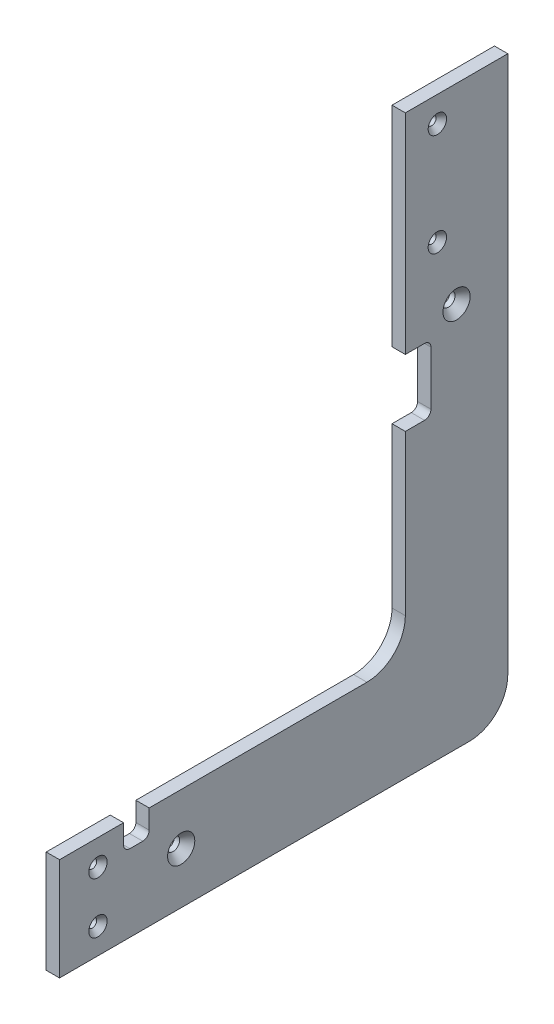
ISO-10303-21;
HEADER;
FILE_DESCRIPTION(('STEP AP214'),'2;1');
FILE_NAME('part.step','',(''),(''),'','','');
FILE_SCHEMA(('AUTOMOTIVE_DESIGN { 1 0 10303 214 1 1 1 1 }'));
ENDSEC;
DATA;
#1=APPLICATION_CONTEXT('core data for automotive mechanical design processes');
#2=APPLICATION_PROTOCOL_DEFINITION('international standard','automotive_design',2000,#1);
#3=PRODUCT_CONTEXT('',#1,'mechanical');
#4=PRODUCT('Part','Part','',(#3));
#5=PRODUCT_RELATED_PRODUCT_CATEGORY('part','',(#4));
#6=PRODUCT_DEFINITION_FORMATION('','',#4);
#7=PRODUCT_DEFINITION_CONTEXT('part definition',#1,'design');
#8=PRODUCT_DEFINITION('design','',#6,#7);
#9=PRODUCT_DEFINITION_SHAPE('','',#8);
#10=(LENGTH_UNIT() NAMED_UNIT(*) SI_UNIT(.MILLI.,.METRE.));
#11=(NAMED_UNIT(*) PLANE_ANGLE_UNIT() SI_UNIT($,.RADIAN.));
#12=(NAMED_UNIT(*) SI_UNIT($,.STERADIAN.) SOLID_ANGLE_UNIT());
#13=UNCERTAINTY_MEASURE_WITH_UNIT(LENGTH_MEASURE(1.E-05),#10,'distance_accuracy_value','');
#14=(GEOMETRIC_REPRESENTATION_CONTEXT(3) GLOBAL_UNCERTAINTY_ASSIGNED_CONTEXT((#13)) GLOBAL_UNIT_ASSIGNED_CONTEXT((#10,
#11,#12)) REPRESENTATION_CONTEXT('',''));
#15=CARTESIAN_POINT('',(0.,0.,0.));
#16=DIRECTION('',(0.,0.,1.));
#17=DIRECTION('',(1.,0.,0.));
#18=AXIS2_PLACEMENT_3D('',#15,#16,#17);
#19=CARTESIAN_POINT('',(6.604,-234.95,0.));
#20=DIRECTION('',(0.,1.,0.));
#21=DIRECTION('',(0.,0.,1.));
#22=AXIS2_PLACEMENT_3D('',#19,#20,#21);
#23=PLANE('',#22);
#24=DIRECTION('',(-1.,0.,0.));
#25=VECTOR('',#24,1.);
#26=CARTESIAN_POINT('',(6.604,-234.95,-44.45));
#27=LINE('',#26,#25);
#28=CARTESIAN_POINT('',(6.604,-234.95,-44.45));
#29=VERTEX_POINT('',#28);
#30=CARTESIAN_POINT('',(0.,-234.95,-44.45));
#31=VERTEX_POINT('',#30);
#32=EDGE_CURVE('E215',#29,#31,#27,.T.);
#33=ORIENTED_EDGE('',*,*,#32,.F.);
#34=DIRECTION('',(0.,0.,-1.));
#35=VECTOR('',#34,1.);
#36=CARTESIAN_POINT('',(6.604,-234.95,0.));
#37=LINE('',#36,#35);
#38=CARTESIAN_POINT('',(6.604,-234.95,-152.4));
#39=VERTEX_POINT('',#38);
#40=EDGE_CURVE('E195',#29,#39,#37,.T.);
#41=ORIENTED_EDGE('',*,*,#40,.T.);
#42=DIRECTION('',(-1.,0.,0.));
#43=VECTOR('',#42,1.);
#44=CARTESIAN_POINT('',(6.604,-234.95,-152.4));
#45=LINE('',#44,#43);
#46=CARTESIAN_POINT('',(0.,-234.95,-152.4));
#47=VERTEX_POINT('',#46);
#48=EDGE_CURVE('E44',#39,#47,#45,.T.);
#49=ORIENTED_EDGE('',*,*,#48,.T.);
#50=DIRECTION('',(0.,0.,-1.));
#51=VECTOR('',#50,1.);
#52=CARTESIAN_POINT('',(0.,-234.95,0.));
#53=LINE('',#52,#51);
#54=EDGE_CURVE('E348',#31,#47,#53,.T.);
#55=ORIENTED_EDGE('',*,*,#54,.F.);
#56=EDGE_LOOP('',(#33,#41,#49,#55));
#57=FACE_BOUND('',#56,.T.);
#58=ADVANCED_FACE('F36',(#57),#23,.T.);
#59=CARTESIAN_POINT('',(6.604,0.,-171.45));
#60=DIRECTION('',(0.,0.,-1.));
#61=DIRECTION('',(0.,1.,0.));
#62=AXIS2_PLACEMENT_3D('',#59,#60,#61);
#63=PLANE('',#62);
#64=DIRECTION('',(0.,-1.,0.));
#65=VECTOR('',#64,1.);
#66=CARTESIAN_POINT('',(6.604,0.,-171.45));
#67=LINE('',#66,#65);
#68=CARTESIAN_POINT('',(6.604,-136.779,-171.45));
#69=VERTEX_POINT('',#68);
#70=CARTESIAN_POINT('',(6.604,-215.9,-171.45));
#71=VERTEX_POINT('',#70);
#72=EDGE_CURVE('E324',#69,#71,#67,.T.);
#73=ORIENTED_EDGE('',*,*,#72,.F.);
#74=DIRECTION('',(-1.,0.,0.));
#75=VECTOR('',#74,1.);
#76=CARTESIAN_POINT('',(6.604,-136.779,-171.45));
#77=LINE('',#76,#75);
#78=CARTESIAN_POINT('',(0.,-136.779,-171.45));
#79=VERTEX_POINT('',#78);
#80=EDGE_CURVE('E253',#69,#79,#77,.T.);
#81=ORIENTED_EDGE('',*,*,#80,.T.);
#82=DIRECTION('',(0.,-1.,0.));
#83=VECTOR('',#82,1.);
#84=CARTESIAN_POINT('',(0.,0.,-171.45));
#85=LINE('',#84,#83);
#86=CARTESIAN_POINT('',(0.,-215.9,-171.45));
#87=VERTEX_POINT('',#86);
#88=EDGE_CURVE('E319',#79,#87,#85,.T.);
#89=ORIENTED_EDGE('',*,*,#88,.T.);
#90=DIRECTION('',(-1.,0.,0.));
#91=VECTOR('',#90,1.);
#92=CARTESIAN_POINT('',(6.604,-215.9,-171.45));
#93=LINE('',#92,#91);
#94=EDGE_CURVE('E11',#71,#87,#93,.T.);
#95=ORIENTED_EDGE('',*,*,#94,.F.);
#96=EDGE_LOOP('',(#73,#81,#89,#95));
#97=FACE_BOUND('',#96,.T.);
#98=ADVANCED_FACE('F449',(#97),#63,.F.);
#99=CARTESIAN_POINT('',(0.,0.,-171.45));
#100=VERTEX_POINT('',#99);
#101=CARTESIAN_POINT('',(0.,-103.759,-171.45));
#102=VERTEX_POINT('',#101);
#103=EDGE_CURVE('E342',#100,#102,#85,.T.);
#104=ORIENTED_EDGE('',*,*,#103,.T.);
#105=DIRECTION('',(-1.,0.,0.));
#106=VECTOR('',#105,1.);
#107=CARTESIAN_POINT('',(6.604,-103.759,-171.45));
#108=LINE('',#107,#106);
#109=CARTESIAN_POINT('',(6.604,-103.759,-171.45));
#110=VERTEX_POINT('',#109);
#111=EDGE_CURVE('E59',#110,#102,#108,.T.);
#112=ORIENTED_EDGE('',*,*,#111,.F.);
#113=CARTESIAN_POINT('',(6.604,0.,-171.45));
#114=VERTEX_POINT('',#113);
#115=EDGE_CURVE('E320',#114,#110,#67,.T.);
#116=ORIENTED_EDGE('',*,*,#115,.F.);
#117=DIRECTION('',(-1.,0.,0.));
#118=VECTOR('',#117,1.);
#119=CARTESIAN_POINT('',(6.604,0.,-171.45));
#120=LINE('',#119,#118);
#121=EDGE_CURVE('E341',#114,#100,#120,.T.);
#122=ORIENTED_EDGE('',*,*,#121,.T.);
#123=EDGE_LOOP('',(#104,#112,#116,#122));
#124=FACE_BOUND('',#123,.T.);
#125=ADVANCED_FACE('F38',(#124),#63,.F.);
#126=CARTESIAN_POINT('',(6.604,-215.9,-152.4));
#127=DIRECTION('',(-1.,0.,0.));
#128=DIRECTION('',(0.,0.,1.));
#129=AXIS2_PLACEMENT_3D('',#126,#127,#128);
#130=CYLINDRICAL_SURFACE('',#129,19.05);
#131=CARTESIAN_POINT('',(0.,-215.9,-152.4));
#132=DIRECTION('',(1.,0.,0.));
#133=DIRECTION('',(0.,0.,-1.));
#134=AXIS2_PLACEMENT_3D('',#131,#132,#133);
#135=CIRCLE('',#134,19.05);
#136=EDGE_CURVE('E345',#87,#47,#135,.F.);
#137=ORIENTED_EDGE('',*,*,#136,.T.);
#138=ORIENTED_EDGE('',*,*,#48,.F.);
#139=CARTESIAN_POINT('',(6.604,-215.9,-152.4));
#140=DIRECTION('',(1.,0.,0.));
#141=DIRECTION('',(0.,0.,-1.));
#142=AXIS2_PLACEMENT_3D('',#139,#140,#141);
#143=CIRCLE('',#142,19.05);
#144=EDGE_CURVE('E323',#71,#39,#143,.F.);
#145=ORIENTED_EDGE('',*,*,#144,.F.);
#146=ORIENTED_EDGE('',*,*,#94,.T.);
#147=EDGE_LOOP('',(#137,#138,#145,#146));
#148=FACE_BOUND('',#147,.T.);
#149=ADVANCED_FACE('F384',(#148),#130,.F.);
#150=DIRECTION('',(-1.,0.,0.));
#151=VECTOR('',#150,1.);
#152=CARTESIAN_POINT('',(6.604,-234.95,-31.75));
#153=LINE('',#152,#151);
#154=CARTESIAN_POINT('',(6.604,-234.95,-31.75));
#155=VERTEX_POINT('',#154);
#156=CARTESIAN_POINT('',(0.,-234.95,-31.75));
#157=VERTEX_POINT('',#156);
#158=EDGE_CURVE('E218',#155,#157,#153,.T.);
#159=ORIENTED_EDGE('',*,*,#158,.T.);
#160=CARTESIAN_POINT('',(0.,-234.95,0.));
#161=VERTEX_POINT('',#160);
#162=EDGE_CURVE('E349',#161,#157,#53,.T.);
#163=ORIENTED_EDGE('',*,*,#162,.F.);
#164=DIRECTION('',(-1.,0.,0.));
#165=VECTOR('',#164,1.);
#166=CARTESIAN_POINT('',(6.604,-234.95,0.));
#167=LINE('',#166,#165);
#168=CARTESIAN_POINT('',(6.604,-234.95,0.));
#169=VERTEX_POINT('',#168);
#170=EDGE_CURVE('E376',#169,#161,#167,.T.);
#171=ORIENTED_EDGE('',*,*,#170,.F.);
#172=EDGE_CURVE('E326',#169,#155,#37,.T.);
#173=ORIENTED_EDGE('',*,*,#172,.T.);
#174=EDGE_LOOP('',(#159,#163,#171,#173));
#175=FACE_BOUND('',#174,.T.);
#176=ADVANCED_FACE('F404',(#175),#23,.T.);
#177=CARTESIAN_POINT('',(6.604,0.,0.));
#178=DIRECTION('',(0.,0.,-1.));
#179=DIRECTION('',(-1.,0.,0.));
#180=AXIS2_PLACEMENT_3D('',#177,#178,#179);
#181=PLANE('',#180);
#182=DIRECTION('',(0.,-1.,0.));
#183=VECTOR('',#182,1.);
#184=CARTESIAN_POINT('',(0.,0.,0.));
#185=LINE('',#184,#183);
#186=CARTESIAN_POINT('',(0.,-285.75,0.));
#187=VERTEX_POINT('',#186);
#188=EDGE_CURVE('E352',#161,#187,#185,.T.);
#189=ORIENTED_EDGE('',*,*,#188,.T.);
#190=DIRECTION('',(-1.,0.,0.));
#191=VECTOR('',#190,1.);
#192=CARTESIAN_POINT('',(6.604,-285.75,0.));
#193=LINE('',#192,#191);
#194=CARTESIAN_POINT('',(6.604,-285.75,0.));
#195=VERTEX_POINT('',#194);
#196=EDGE_CURVE('E373',#195,#187,#193,.T.);
#197=ORIENTED_EDGE('',*,*,#196,.F.);
#198=DIRECTION('',(0.,-1.,0.));
#199=VECTOR('',#198,1.);
#200=CARTESIAN_POINT('',(6.604,0.,0.));
#201=LINE('',#200,#199);
#202=EDGE_CURVE('E329',#169,#195,#201,.T.);
#203=ORIENTED_EDGE('',*,*,#202,.F.);
#204=ORIENTED_EDGE('',*,*,#170,.T.);
#205=EDGE_LOOP('',(#189,#197,#203,#204));
#206=FACE_BOUND('',#205,.T.);
#207=ADVANCED_FACE('F410',(#206),#181,.F.);
#208=CARTESIAN_POINT('',(6.604,-285.75,0.));
#209=DIRECTION('',(0.,1.,0.));
#210=DIRECTION('',(0.,0.,1.));
#211=AXIS2_PLACEMENT_3D('',#208,#209,#210);
#212=PLANE('',#211);
#213=DIRECTION('',(0.,0.,-1.));
#214=VECTOR('',#213,1.);
#215=CARTESIAN_POINT('',(0.,-285.75,0.));
#216=LINE('',#215,#214);
#217=CARTESIAN_POINT('',(0.,-285.75,-203.2));
#218=VERTEX_POINT('',#217);
#219=EDGE_CURVE('E354',#187,#218,#216,.T.);
#220=ORIENTED_EDGE('',*,*,#219,.T.);
#221=DIRECTION('',(-1.,0.,0.));
#222=VECTOR('',#221,1.);
#223=CARTESIAN_POINT('',(6.604,-285.75,-203.2));
#224=LINE('',#223,#222);
#225=CARTESIAN_POINT('',(6.604,-285.75,-203.2));
#226=VERTEX_POINT('',#225);
#227=EDGE_CURVE('E370',#226,#218,#224,.T.);
#228=ORIENTED_EDGE('',*,*,#227,.F.);
#229=DIRECTION('',(0.,0.,-1.));
#230=VECTOR('',#229,1.);
#231=CARTESIAN_POINT('',(6.604,-285.75,0.));
#232=LINE('',#231,#230);
#233=EDGE_CURVE('E331',#195,#226,#232,.T.);
#234=ORIENTED_EDGE('',*,*,#233,.F.);
#235=ORIENTED_EDGE('',*,*,#196,.T.);
#236=EDGE_LOOP('',(#220,#228,#234,#235));
#237=FACE_BOUND('',#236,.T.);
#238=ADVANCED_FACE('F414',(#237),#212,.F.);
#239=CARTESIAN_POINT('',(6.604,-266.7,-203.2));
#240=DIRECTION('',(-1.,0.,0.));
#241=DIRECTION('',(0.,0.,1.));
#242=AXIS2_PLACEMENT_3D('',#239,#240,#241);
#243=CYLINDRICAL_SURFACE('',#242,19.0500000000001);
#244=CARTESIAN_POINT('',(0.,-266.7,-203.2));
#245=DIRECTION('',(1.,0.,0.));
#246=DIRECTION('',(0.,0.,-1.));
#247=AXIS2_PLACEMENT_3D('',#244,#245,#246);
#248=CIRCLE('',#247,19.0500000000001);
#249=CARTESIAN_POINT('',(0.,-266.7,-222.25));
#250=VERTEX_POINT('',#249);
#251=EDGE_CURVE('E356',#218,#250,#248,.T.);
#252=ORIENTED_EDGE('',*,*,#251,.T.);
#253=DIRECTION('',(-1.,0.,0.));
#254=VECTOR('',#253,1.);
#255=CARTESIAN_POINT('',(6.604,-266.7,-222.25));
#256=LINE('',#255,#254);
#257=CARTESIAN_POINT('',(6.604,-266.7,-222.25));
#258=VERTEX_POINT('',#257);
#259=EDGE_CURVE('E368',#258,#250,#256,.T.);
#260=ORIENTED_EDGE('',*,*,#259,.F.);
#261=CARTESIAN_POINT('',(6.604,-266.7,-203.2));
#262=DIRECTION('',(1.,0.,0.));
#263=DIRECTION('',(0.,0.,-1.));
#264=AXIS2_PLACEMENT_3D('',#261,#262,#263);
#265=CIRCLE('',#264,19.0500000000001);
#266=EDGE_CURVE('E333',#226,#258,#265,.T.);
#267=ORIENTED_EDGE('',*,*,#266,.F.);
#268=ORIENTED_EDGE('',*,*,#227,.T.);
#269=EDGE_LOOP('',(#252,#260,#267,#268));
#270=FACE_BOUND('',#269,.T.);
#271=ADVANCED_FACE('F421',(#270),#243,.T.);
#272=CARTESIAN_POINT('',(6.604,0.,-222.25));
#273=DIRECTION('',(0.,0.,-1.));
#274=DIRECTION('',(0.,1.,0.));
#275=AXIS2_PLACEMENT_3D('',#272,#273,#274);
#276=PLANE('',#275);
#277=DIRECTION('',(0.,-1.,0.));
#278=VECTOR('',#277,1.);
#279=CARTESIAN_POINT('',(0.,0.,-222.25));
#280=LINE('',#279,#278);
#281=CARTESIAN_POINT('',(0.,0.,-222.25));
#282=VERTEX_POINT('',#281);
#283=EDGE_CURVE('E359',#282,#250,#280,.T.);
#284=ORIENTED_EDGE('',*,*,#283,.F.);
#285=DIRECTION('',(-1.,0.,0.));
#286=VECTOR('',#285,1.);
#287=CARTESIAN_POINT('',(6.604,0.,-222.25));
#288=LINE('',#287,#286);
#289=CARTESIAN_POINT('',(6.604,0.,-222.25));
#290=VERTEX_POINT('',#289);
#291=EDGE_CURVE('E366',#290,#282,#288,.T.);
#292=ORIENTED_EDGE('',*,*,#291,.F.);
#293=DIRECTION('',(0.,-1.,0.));
#294=VECTOR('',#293,1.);
#295=CARTESIAN_POINT('',(6.604,0.,-222.25));
#296=LINE('',#295,#294);
#297=EDGE_CURVE('E335',#290,#258,#296,.T.);
#298=ORIENTED_EDGE('',*,*,#297,.T.);
#299=ORIENTED_EDGE('',*,*,#259,.T.);
#300=EDGE_LOOP('',(#284,#292,#298,#299));
#301=FACE_BOUND('',#300,.T.);
#302=ADVANCED_FACE('F424',(#301),#276,.T.);
#303=CARTESIAN_POINT('',(6.604,0.,0.));
#304=DIRECTION('',(0.,1.,0.));
#305=DIRECTION('',(0.,0.,1.));
#306=AXIS2_PLACEMENT_3D('',#303,#304,#305);
#307=PLANE('',#306);
#308=DIRECTION('',(0.,0.,-1.));
#309=VECTOR('',#308,1.);
#310=CARTESIAN_POINT('',(0.,0.,0.));
#311=LINE('',#310,#309);
#312=EDGE_CURVE('E362',#100,#282,#311,.T.);
#313=ORIENTED_EDGE('',*,*,#312,.F.);
#314=ORIENTED_EDGE('',*,*,#121,.F.);
#315=DIRECTION('',(0.,0.,-1.));
#316=VECTOR('',#315,1.);
#317=CARTESIAN_POINT('',(6.604,0.,0.));
#318=LINE('',#317,#316);
#319=EDGE_CURVE('E338',#114,#290,#318,.T.);
#320=ORIENTED_EDGE('',*,*,#319,.T.);
#321=ORIENTED_EDGE('',*,*,#291,.T.);
#322=EDGE_LOOP('',(#313,#314,#320,#321));
#323=FACE_BOUND('',#322,.T.);
#324=ADVANCED_FACE('F427',(#323),#307,.T.);
#325=CARTESIAN_POINT('',(6.604,0.,0.));
#326=DIRECTION('',(1.,0.,0.));
#327=DIRECTION('',(0.,0.,-1.));
#328=AXIS2_PLACEMENT_3D('',#325,#326,#327);
#329=PLANE('',#328);
#330=DIRECTION('',(0.,-1.,0.));
#331=VECTOR('',#330,1.);
#332=CARTESIAN_POINT('',(6.604,-234.95,-44.45));
#333=LINE('',#332,#331);
#334=CARTESIAN_POINT('',(6.604,-244.475,-44.45));
#335=VERTEX_POINT('',#334);
#336=EDGE_CURVE('E175',#29,#335,#333,.T.);
#337=ORIENTED_EDGE('',*,*,#336,.T.);
#338=CARTESIAN_POINT('',(6.604,-244.475,-41.275));
#339=DIRECTION('',(-1.,0.,0.));
#340=DIRECTION('',(0.,0.,-1.));
#341=AXIS2_PLACEMENT_3D('',#338,#339,#340);
#342=CIRCLE('',#341,3.17500000000001);
#343=CARTESIAN_POINT('',(6.604,-247.65,-41.275));
#344=VERTEX_POINT('',#343);
#345=EDGE_CURVE('E184',#335,#344,#342,.T.);
#346=ORIENTED_EDGE('',*,*,#345,.T.);
#347=DIRECTION('',(0.,0.,1.));
#348=VECTOR('',#347,1.);
#349=CARTESIAN_POINT('',(6.604,-247.65,-41.275));
#350=LINE('',#349,#348);
#351=CARTESIAN_POINT('',(6.604,-247.65,-34.925));
#352=VERTEX_POINT('',#351);
#353=EDGE_CURVE('E189',#344,#352,#350,.T.);
#354=ORIENTED_EDGE('',*,*,#353,.T.);
#355=CARTESIAN_POINT('',(6.604,-244.475,-34.925));
#356=DIRECTION('',(-1.,0.,0.));
#357=DIRECTION('',(0.,0.,1.));
#358=AXIS2_PLACEMENT_3D('',#355,#356,#357);
#359=CIRCLE('',#358,3.175);
#360=CARTESIAN_POINT('',(6.604,-244.475,-31.75));
#361=VERTEX_POINT('',#360);
#362=EDGE_CURVE('E202',#352,#361,#359,.T.);
#363=ORIENTED_EDGE('',*,*,#362,.T.);
#364=DIRECTION('',(0.,1.,0.));
#365=VECTOR('',#364,1.);
#366=CARTESIAN_POINT('',(6.604,-234.95,-31.75));
#367=LINE('',#366,#365);
#368=EDGE_CURVE('E181',#361,#155,#367,.T.);
#369=ORIENTED_EDGE('',*,*,#368,.T.);
#370=ORIENTED_EDGE('',*,*,#172,.F.);
#371=ORIENTED_EDGE('',*,*,#202,.T.);
#372=ORIENTED_EDGE('',*,*,#233,.T.);
#373=ORIENTED_EDGE('',*,*,#266,.T.);
#374=ORIENTED_EDGE('',*,*,#297,.F.);
#375=ORIENTED_EDGE('',*,*,#319,.F.);
#376=ORIENTED_EDGE('',*,*,#115,.T.);
#377=DIRECTION('',(0.,0.,-1.));
#378=VECTOR('',#377,1.);
#379=CARTESIAN_POINT('',(6.604,-103.759,-171.45));
#380=LINE('',#379,#378);
#381=CARTESIAN_POINT('',(6.604,-103.759,-180.975));
#382=VERTEX_POINT('',#381);
#383=EDGE_CURVE('E226',#110,#382,#380,.T.);
#384=ORIENTED_EDGE('',*,*,#383,.T.);
#385=CARTESIAN_POINT('',(6.604,-106.934,-180.975));
#386=DIRECTION('',(-1.,0.,0.));
#387=DIRECTION('',(0.,0.,-1.));
#388=AXIS2_PLACEMENT_3D('',#385,#386,#387);
#389=CIRCLE('',#388,3.175);
#390=CARTESIAN_POINT('',(6.604,-106.934,-184.15));
#391=VERTEX_POINT('',#390);
#392=EDGE_CURVE('E229',#382,#391,#389,.T.);
#393=ORIENTED_EDGE('',*,*,#392,.T.);
#394=DIRECTION('',(0.,-1.,0.));
#395=VECTOR('',#394,1.);
#396=CARTESIAN_POINT('',(6.604,-106.934,-184.15));
#397=LINE('',#396,#395);
#398=CARTESIAN_POINT('',(6.604,-133.604,-184.15));
#399=VERTEX_POINT('',#398);
#400=EDGE_CURVE('E233',#391,#399,#397,.T.);
#401=ORIENTED_EDGE('',*,*,#400,.T.);
#402=CARTESIAN_POINT('',(6.604,-133.604,-180.975));
#403=DIRECTION('',(-1.,0.,0.));
#404=DIRECTION('',(0.,0.,-1.));
#405=AXIS2_PLACEMENT_3D('',#402,#403,#404);
#406=CIRCLE('',#405,3.175);
#407=CARTESIAN_POINT('',(6.604,-136.779,-180.975));
#408=VERTEX_POINT('',#407);
#409=EDGE_CURVE('E236',#399,#408,#406,.T.);
#410=ORIENTED_EDGE('',*,*,#409,.T.);
#411=DIRECTION('',(0.,0.,1.));
#412=VECTOR('',#411,1.);
#413=CARTESIAN_POINT('',(6.604,-136.779,-171.45));
#414=LINE('',#413,#412);
#415=EDGE_CURVE('E239',#408,#69,#414,.T.);
#416=ORIENTED_EDGE('',*,*,#415,.T.);
#417=ORIENTED_EDGE('',*,*,#72,.T.);
#418=ORIENTED_EDGE('',*,*,#144,.T.);
#419=ORIENTED_EDGE('',*,*,#40,.F.);
#420=EDGE_LOOP('',(#337,#346,#354,#363,#369,#370,#371,#372,#373,#374,#375,#376,#384,#393,#401,
#410,#416,#417,#418,#419));
#421=FACE_BOUND('',#420,.T.);
#422=CARTESIAN_POINT('',(6.604,-94.869,-196.85));
#423=DIRECTION('',(1.,0.,0.));
#424=DIRECTION('',(0.,0.,-1.));
#425=AXIS2_PLACEMENT_3D('',#422,#423,#424);
#426=CIRCLE('',#425,6.7437);
#427=CARTESIAN_POINT('',(6.604,-94.869,-203.5937));
#428=VERTEX_POINT('',#427);
#429=EDGE_CURVE('E256',#428,#428,#426,.T.);
#430=ORIENTED_EDGE('',*,*,#429,.F.);
#431=EDGE_LOOP('',(#430));
#432=FACE_BOUND('',#431,.T.);
#433=CARTESIAN_POINT('',(6.604,-260.35,-60.325));
#434=DIRECTION('',(1.,0.,0.));
#435=DIRECTION('',(0.,0.,-1.));
#436=AXIS2_PLACEMENT_3D('',#433,#434,#435);
#437=CIRCLE('',#436,6.74370000000002);
#438=CARTESIAN_POINT('',(6.604,-260.35,-67.0687));
#439=VERTEX_POINT('',#438);
#440=EDGE_CURVE('E274',#439,#439,#437,.T.);
#441=ORIENTED_EDGE('',*,*,#440,.F.);
#442=EDGE_LOOP('',(#441));
#443=FACE_BOUND('',#442,.T.);
#444=CARTESIAN_POINT('',(6.604,-247.65,-19.05));
#445=DIRECTION('',(1.,0.,0.));
#446=DIRECTION('',(0.,0.,-1.));
#447=AXIS2_PLACEMENT_3D('',#444,#445,#446);
#448=CIRCLE('',#447,4.55929999999999);
#449=CARTESIAN_POINT('',(6.604,-247.65,-23.6093));
#450=VERTEX_POINT('',#449);
#451=EDGE_CURVE('E283',#450,#450,#448,.T.);
#452=ORIENTED_EDGE('',*,*,#451,.F.);
#453=EDGE_LOOP('',(#452));
#454=FACE_BOUND('',#453,.T.);
#455=CARTESIAN_POINT('',(6.604,-273.05,-19.05));
#456=DIRECTION('',(1.,0.,0.));
#457=DIRECTION('',(0.,0.,-1.));
#458=AXIS2_PLACEMENT_3D('',#455,#456,#457);
#459=CIRCLE('',#458,4.55929999999999);
#460=CARTESIAN_POINT('',(6.604,-273.05,-23.6093));
#461=VERTEX_POINT('',#460);
#462=EDGE_CURVE('E292',#461,#461,#459,.T.);
#463=ORIENTED_EDGE('',*,*,#462,.F.);
#464=EDGE_LOOP('',(#463));
#465=FACE_BOUND('',#464,.T.);
#466=CARTESIAN_POINT('',(6.604,-12.7,-187.325));
#467=DIRECTION('',(1.,0.,0.));
#468=DIRECTION('',(0.,0.,-1.));
#469=AXIS2_PLACEMENT_3D('',#466,#467,#468);
#470=CIRCLE('',#469,4.5593);
#471=CARTESIAN_POINT('',(6.604,-12.7,-191.8843));
#472=VERTEX_POINT('',#471);
#473=EDGE_CURVE('E301',#472,#472,#470,.T.);
#474=ORIENTED_EDGE('',*,*,#473,.F.);
#475=EDGE_LOOP('',(#474));
#476=FACE_BOUND('',#475,.T.);
#477=CARTESIAN_POINT('',(6.604,-63.5,-187.325));
#478=DIRECTION('',(1.,0.,0.));
#479=DIRECTION('',(0.,0.,-1.));
#480=AXIS2_PLACEMENT_3D('',#477,#478,#479);
#481=CIRCLE('',#480,4.5593);
#482=CARTESIAN_POINT('',(6.604,-63.5,-191.8843));
#483=VERTEX_POINT('',#482);
#484=EDGE_CURVE('E310',#483,#483,#481,.T.);
#485=ORIENTED_EDGE('',*,*,#484,.F.);
#486=EDGE_LOOP('',(#485));
#487=FACE_BOUND('',#486,.T.);
#488=ADVANCED_FACE('F192',(#421,#432,#443,#454,#465,#476,#487),#329,.T.);
#489=CARTESIAN_POINT('',(0.,0.,0.));
#490=DIRECTION('',(1.,0.,0.));
#491=DIRECTION('',(0.,0.,-1.));
#492=AXIS2_PLACEMENT_3D('',#489,#490,#491);
#493=PLANE('',#492);
#494=CARTESIAN_POINT('',(0.,-94.869,-196.85));
#495=DIRECTION('',(1.,0.,0.));
#496=DIRECTION('',(0.,0.,-1.));
#497=AXIS2_PLACEMENT_3D('',#494,#495,#496);
#498=CIRCLE('',#497,3.2639);
#499=CARTESIAN_POINT('',(0.,-94.869,-200.1139));
#500=VERTEX_POINT('',#499);
#501=EDGE_CURVE('E271',#500,#500,#498,.T.);
#502=ORIENTED_EDGE('',*,*,#501,.T.);
#503=EDGE_LOOP('',(#502));
#504=FACE_BOUND('',#503,.T.);
#505=CARTESIAN_POINT('',(0.,-260.35,-60.325));
#506=DIRECTION('',(1.,0.,0.));
#507=DIRECTION('',(0.,0.,-1.));
#508=AXIS2_PLACEMENT_3D('',#505,#506,#507);
#509=CIRCLE('',#508,3.26389999999999);
#510=CARTESIAN_POINT('',(0.,-260.35,-63.5889));
#511=VERTEX_POINT('',#510);
#512=EDGE_CURVE('E280',#511,#511,#509,.T.);
#513=ORIENTED_EDGE('',*,*,#512,.T.);
#514=EDGE_LOOP('',(#513));
#515=FACE_BOUND('',#514,.T.);
#516=CARTESIAN_POINT('',(0.,-247.65,-19.05));
#517=DIRECTION('',(1.,0.,0.));
#518=DIRECTION('',(0.,0.,-1.));
#519=AXIS2_PLACEMENT_3D('',#516,#517,#518);
#520=CIRCLE('',#519,2.15265000000001);
#521=CARTESIAN_POINT('',(0.,-247.65,-21.20265));
#522=VERTEX_POINT('',#521);
#523=EDGE_CURVE('E289',#522,#522,#520,.T.);
#524=ORIENTED_EDGE('',*,*,#523,.T.);
#525=EDGE_LOOP('',(#524));
#526=FACE_BOUND('',#525,.T.);
#527=CARTESIAN_POINT('',(0.,-273.05,-19.05));
#528=DIRECTION('',(1.,0.,0.));
#529=DIRECTION('',(0.,0.,-1.));
#530=AXIS2_PLACEMENT_3D('',#527,#528,#529);
#531=CIRCLE('',#530,2.15264999999998);
#532=CARTESIAN_POINT('',(0.,-273.05,-21.20265));
#533=VERTEX_POINT('',#532);
#534=EDGE_CURVE('E298',#533,#533,#531,.T.);
#535=ORIENTED_EDGE('',*,*,#534,.T.);
#536=EDGE_LOOP('',(#535));
#537=FACE_BOUND('',#536,.T.);
#538=CARTESIAN_POINT('',(0.,-12.7,-187.325));
#539=DIRECTION('',(1.,0.,0.));
#540=DIRECTION('',(0.,0.,-1.));
#541=AXIS2_PLACEMENT_3D('',#538,#539,#540);
#542=CIRCLE('',#541,2.15265);
#543=CARTESIAN_POINT('',(0.,-12.7,-189.47765));
#544=VERTEX_POINT('',#543);
#545=EDGE_CURVE('E307',#544,#544,#542,.T.);
#546=ORIENTED_EDGE('',*,*,#545,.T.);
#547=EDGE_LOOP('',(#546));
#548=FACE_BOUND('',#547,.T.);
#549=CARTESIAN_POINT('',(0.,-63.5,-187.325));
#550=DIRECTION('',(1.,0.,0.));
#551=DIRECTION('',(0.,0.,-1.));
#552=AXIS2_PLACEMENT_3D('',#549,#550,#551);
#553=CIRCLE('',#552,2.15265);
#554=CARTESIAN_POINT('',(0.,-63.5,-189.47765));
#555=VERTEX_POINT('',#554);
#556=EDGE_CURVE('E316',#555,#555,#553,.T.);
#557=ORIENTED_EDGE('',*,*,#556,.T.);
#558=EDGE_LOOP('',(#557));
#559=FACE_BOUND('',#558,.T.);
#560=CARTESIAN_POINT('',(0.,-244.475,-41.275));
#561=DIRECTION('',(-1.,0.,0.));
#562=DIRECTION('',(0.,0.,-1.));
#563=AXIS2_PLACEMENT_3D('',#560,#561,#562);
#564=CIRCLE('',#563,3.17500000000001);
#565=CARTESIAN_POINT('',(0.,-244.475,-44.45));
#566=VERTEX_POINT('',#565);
#567=CARTESIAN_POINT('',(0.,-247.65,-41.275));
#568=VERTEX_POINT('',#567);
#569=EDGE_CURVE('E208',#566,#568,#564,.T.);
#570=ORIENTED_EDGE('',*,*,#569,.F.);
#571=DIRECTION('',(0.,-1.,0.));
#572=VECTOR('',#571,1.);
#573=CARTESIAN_POINT('',(0.,-234.95,-44.45));
#574=LINE('',#573,#572);
#575=EDGE_CURVE('E51',#31,#566,#574,.T.);
#576=ORIENTED_EDGE('',*,*,#575,.F.);
#577=ORIENTED_EDGE('',*,*,#54,.T.);
#578=ORIENTED_EDGE('',*,*,#136,.F.);
#579=ORIENTED_EDGE('',*,*,#88,.F.);
#580=DIRECTION('',(0.,0.,1.));
#581=VECTOR('',#580,1.);
#582=CARTESIAN_POINT('',(0.,-136.779,-171.45));
#583=LINE('',#582,#581);
#584=CARTESIAN_POINT('',(0.,-136.779,-180.975));
#585=VERTEX_POINT('',#584);
#586=EDGE_CURVE('E230',#585,#79,#583,.T.);
#587=ORIENTED_EDGE('',*,*,#586,.F.);
#588=CARTESIAN_POINT('',(0.,-133.604,-180.975));
#589=DIRECTION('',(-1.,0.,0.));
#590=DIRECTION('',(0.,0.,-1.));
#591=AXIS2_PLACEMENT_3D('',#588,#589,#590);
#592=CIRCLE('',#591,3.175);
#593=CARTESIAN_POINT('',(0.,-133.604,-184.15));
#594=VERTEX_POINT('',#593);
#595=EDGE_CURVE('E249',#594,#585,#592,.T.);
#596=ORIENTED_EDGE('',*,*,#595,.F.);
#597=DIRECTION('',(0.,-1.,0.));
#598=VECTOR('',#597,1.);
#599=CARTESIAN_POINT('',(0.,-106.934,-184.15));
#600=LINE('',#599,#598);
#601=CARTESIAN_POINT('',(0.,-106.934,-184.15));
#602=VERTEX_POINT('',#601);
#603=EDGE_CURVE('E246',#602,#594,#600,.T.);
#604=ORIENTED_EDGE('',*,*,#603,.F.);
#605=CARTESIAN_POINT('',(0.,-106.934,-180.975));
#606=DIRECTION('',(-1.,0.,0.));
#607=DIRECTION('',(0.,0.,-1.));
#608=AXIS2_PLACEMENT_3D('',#605,#606,#607);
#609=CIRCLE('',#608,3.175);
#610=CARTESIAN_POINT('',(0.,-103.759,-180.975));
#611=VERTEX_POINT('',#610);
#612=EDGE_CURVE('E243',#611,#602,#609,.T.);
#613=ORIENTED_EDGE('',*,*,#612,.F.);
#614=DIRECTION('',(0.,0.,-1.));
#615=VECTOR('',#614,1.);
#616=CARTESIAN_POINT('',(0.,-103.759,-171.45));
#617=LINE('',#616,#615);
#618=EDGE_CURVE('E217',#102,#611,#617,.T.);
#619=ORIENTED_EDGE('',*,*,#618,.F.);
#620=ORIENTED_EDGE('',*,*,#103,.F.);
#621=ORIENTED_EDGE('',*,*,#312,.T.);
#622=ORIENTED_EDGE('',*,*,#283,.T.);
#623=ORIENTED_EDGE('',*,*,#251,.F.);
#624=ORIENTED_EDGE('',*,*,#219,.F.);
#625=ORIENTED_EDGE('',*,*,#188,.F.);
#626=ORIENTED_EDGE('',*,*,#162,.T.);
#627=DIRECTION('',(0.,1.,0.));
#628=VECTOR('',#627,1.);
#629=CARTESIAN_POINT('',(0.,-234.95,-31.75));
#630=LINE('',#629,#628);
#631=CARTESIAN_POINT('',(0.,-244.475,-31.75));
#632=VERTEX_POINT('',#631);
#633=EDGE_CURVE('E196',#632,#157,#630,.T.);
#634=ORIENTED_EDGE('',*,*,#633,.F.);
#635=CARTESIAN_POINT('',(0.,-244.475,-34.925));
#636=DIRECTION('',(-1.,0.,0.));
#637=DIRECTION('',(0.,0.,1.));
#638=AXIS2_PLACEMENT_3D('',#635,#636,#637);
#639=CIRCLE('',#638,3.175);
#640=CARTESIAN_POINT('',(0.,-247.65,-34.925));
#641=VERTEX_POINT('',#640);
#642=EDGE_CURVE('E198',#641,#632,#639,.T.);
#643=ORIENTED_EDGE('',*,*,#642,.F.);
#644=DIRECTION('',(0.,0.,1.));
#645=VECTOR('',#644,1.);
#646=CARTESIAN_POINT('',(0.,-247.65,-41.275));
#647=LINE('',#646,#645);
#648=EDGE_CURVE('E210',#568,#641,#647,.T.);
#649=ORIENTED_EDGE('',*,*,#648,.F.);
#650=EDGE_LOOP('',(#570,#576,#577,#578,#579,#587,#596,#604,#613,#619,#620,#621,#622,#623,#624,
#625,#626,#634,#643,#649));
#651=FACE_BOUND('',#650,.T.);
#652=ADVANCED_FACE('F388',(#504,#515,#526,#537,#548,#559,#651),#493,.F.);
#653=CARTESIAN_POINT('',(6.604,-63.5,-187.325));
#654=DIRECTION('',(1.,0.,0.));
#655=DIRECTION('',(0.,0.,-1.));
#656=AXIS2_PLACEMENT_3D('',#653,#654,#655);
#657=CYLINDRICAL_SURFACE('',#656,2.15265);
#658=ORIENTED_EDGE('',*,*,#556,.F.);
#659=EDGE_LOOP('',(#658));
#660=FACE_BOUND('',#659,.T.);
#661=CARTESIAN_POINT('',(3.83546587276156,-63.5,-187.325));
#662=DIRECTION('',(1.,0.,0.));
#663=DIRECTION('',(0.,0.,-1.));
#664=AXIS2_PLACEMENT_3D('',#661,#662,#663);
#665=CIRCLE('',#664,2.15265);
#666=CARTESIAN_POINT('',(3.83546587276156,-63.5,-189.47765));
#667=VERTEX_POINT('',#666);
#668=EDGE_CURVE('E313',#667,#667,#665,.T.);
#669=ORIENTED_EDGE('',*,*,#668,.T.);
#670=EDGE_LOOP('',(#669));
#671=FACE_BOUND('',#670,.T.);
#672=ADVANCED_FACE('F497',(#660,#671),#657,.F.);
#673=CARTESIAN_POINT('',(6.604,-63.5,-187.325));
#674=DIRECTION('',(1.,0.,0.));
#675=DIRECTION('',(0.,0.,-1.));
#676=AXIS2_PLACEMENT_3D('',#673,#674,#675);
#677=CONICAL_SURFACE('',#676,4.5593,0.715584993317676);
#678=ORIENTED_EDGE('',*,*,#668,.F.);
#679=EDGE_LOOP('',(#678));
#680=FACE_BOUND('',#679,.T.);
#681=ORIENTED_EDGE('',*,*,#484,.T.);
#682=EDGE_LOOP('',(#681));
#683=FACE_BOUND('',#682,.T.);
#684=ADVANCED_FACE('F625',(#680,#683),#677,.F.);
#685=CARTESIAN_POINT('',(6.604,-12.7,-187.325));
#686=DIRECTION('',(1.,0.,0.));
#687=DIRECTION('',(0.,0.,-1.));
#688=AXIS2_PLACEMENT_3D('',#685,#686,#687);
#689=CYLINDRICAL_SURFACE('',#688,2.15265);
#690=ORIENTED_EDGE('',*,*,#545,.F.);
#691=EDGE_LOOP('',(#690));
#692=FACE_BOUND('',#691,.T.);
#693=CARTESIAN_POINT('',(3.83546587276156,-12.7,-187.325));
#694=DIRECTION('',(1.,0.,0.));
#695=DIRECTION('',(0.,0.,-1.));
#696=AXIS2_PLACEMENT_3D('',#693,#694,#695);
#697=CIRCLE('',#696,2.15265);
#698=CARTESIAN_POINT('',(3.83546587276156,-12.7,-189.47765));
#699=VERTEX_POINT('',#698);
#700=EDGE_CURVE('E304',#699,#699,#697,.T.);
#701=ORIENTED_EDGE('',*,*,#700,.T.);
#702=EDGE_LOOP('',(#701));
#703=FACE_BOUND('',#702,.T.);
#704=ADVANCED_FACE('F621',(#692,#703),#689,.F.);
#705=CARTESIAN_POINT('',(6.604,-12.7,-187.325));
#706=DIRECTION('',(1.,0.,0.));
#707=DIRECTION('',(0.,0.,-1.));
#708=AXIS2_PLACEMENT_3D('',#705,#706,#707);
#709=CONICAL_SURFACE('',#708,4.5593,0.715584993317675);
#710=ORIENTED_EDGE('',*,*,#700,.F.);
#711=EDGE_LOOP('',(#710));
#712=FACE_BOUND('',#711,.T.);
#713=ORIENTED_EDGE('',*,*,#473,.T.);
#714=EDGE_LOOP('',(#713));
#715=FACE_BOUND('',#714,.T.);
#716=ADVANCED_FACE('F617',(#712,#715),#709,.F.);
#717=CARTESIAN_POINT('',(6.604,-273.05,-19.05));
#718=DIRECTION('',(1.,0.,0.));
#719=DIRECTION('',(0.,0.,-1.));
#720=AXIS2_PLACEMENT_3D('',#717,#718,#719);
#721=CYLINDRICAL_SURFACE('',#720,2.15264999999998);
#722=ORIENTED_EDGE('',*,*,#534,.F.);
#723=EDGE_LOOP('',(#722));
#724=FACE_BOUND('',#723,.T.);
#725=CARTESIAN_POINT('',(3.83546587276154,-273.05,-19.05));
#726=DIRECTION('',(1.,0.,0.));
#727=DIRECTION('',(0.,0.,-1.));
#728=AXIS2_PLACEMENT_3D('',#725,#726,#727);
#729=CIRCLE('',#728,2.15264999999998);
#730=CARTESIAN_POINT('',(3.83546587276154,-273.05,-21.20265));
#731=VERTEX_POINT('',#730);
#732=EDGE_CURVE('E295',#731,#731,#729,.T.);
#733=ORIENTED_EDGE('',*,*,#732,.T.);
#734=EDGE_LOOP('',(#733));
#735=FACE_BOUND('',#734,.T.);
#736=ADVANCED_FACE('F613',(#724,#735),#721,.F.);
#737=CARTESIAN_POINT('',(6.604,-273.05,-19.05));
#738=DIRECTION('',(1.,0.,0.));
#739=DIRECTION('',(0.,0.,-1.));
#740=AXIS2_PLACEMENT_3D('',#737,#738,#739);
#741=CONICAL_SURFACE('',#740,4.55929999999999,0.715584993317674);
#742=ORIENTED_EDGE('',*,*,#732,.F.);
#743=EDGE_LOOP('',(#742));
#744=FACE_BOUND('',#743,.T.);
#745=ORIENTED_EDGE('',*,*,#462,.T.);
#746=EDGE_LOOP('',(#745));
#747=FACE_BOUND('',#746,.T.);
#748=ADVANCED_FACE('F609',(#744,#747),#741,.F.);
#749=CARTESIAN_POINT('',(6.604,-247.65,-19.05));
#750=DIRECTION('',(1.,0.,0.));
#751=DIRECTION('',(0.,0.,-1.));
#752=AXIS2_PLACEMENT_3D('',#749,#750,#751);
#753=CYLINDRICAL_SURFACE('',#752,2.15264999999999);
#754=ORIENTED_EDGE('',*,*,#523,.F.);
#755=EDGE_LOOP('',(#754));
#756=FACE_BOUND('',#755,.T.);
#757=CARTESIAN_POINT('',(3.83546587276154,-247.65,-19.05));
#758=DIRECTION('',(1.,0.,0.));
#759=DIRECTION('',(0.,0.,-1.));
#760=AXIS2_PLACEMENT_3D('',#757,#758,#759);
#761=CIRCLE('',#760,2.15264999999998);
#762=CARTESIAN_POINT('',(3.83546587276154,-247.65,-21.20265));
#763=VERTEX_POINT('',#762);
#764=EDGE_CURVE('E286',#763,#763,#761,.T.);
#765=ORIENTED_EDGE('',*,*,#764,.T.);
#766=EDGE_LOOP('',(#765));
#767=FACE_BOUND('',#766,.T.);
#768=ADVANCED_FACE('F605',(#756,#767),#753,.F.);
#769=CARTESIAN_POINT('',(6.604,-247.65,-19.05));
#770=DIRECTION('',(1.,0.,0.));
#771=DIRECTION('',(0.,0.,-1.));
#772=AXIS2_PLACEMENT_3D('',#769,#770,#771);
#773=CONICAL_SURFACE('',#772,4.55929999999999,0.715584993317674);
#774=ORIENTED_EDGE('',*,*,#764,.F.);
#775=EDGE_LOOP('',(#774));
#776=FACE_BOUND('',#775,.T.);
#777=ORIENTED_EDGE('',*,*,#451,.T.);
#778=EDGE_LOOP('',(#777));
#779=FACE_BOUND('',#778,.T.);
#780=ADVANCED_FACE('F601',(#776,#779),#773,.F.);
#781=CARTESIAN_POINT('',(6.604,-260.35,-60.325));
#782=DIRECTION('',(1.,0.,0.));
#783=DIRECTION('',(0.,0.,-1.));
#784=AXIS2_PLACEMENT_3D('',#781,#782,#783);
#785=CYLINDRICAL_SURFACE('',#784,3.26389999999999);
#786=ORIENTED_EDGE('',*,*,#512,.F.);
#787=EDGE_LOOP('',(#786));
#788=FACE_BOUND('',#787,.T.);
#789=CARTESIAN_POINT('',(2.60094801655233,-260.35,-60.325));
#790=DIRECTION('',(1.,0.,0.));
#791=DIRECTION('',(0.,0.,-1.));
#792=AXIS2_PLACEMENT_3D('',#789,#790,#791);
#793=CIRCLE('',#792,3.26389999999999);
#794=CARTESIAN_POINT('',(2.60094801655233,-260.35,-63.5889));
#795=VERTEX_POINT('',#794);
#796=EDGE_CURVE('E277',#795,#795,#793,.T.);
#797=ORIENTED_EDGE('',*,*,#796,.T.);
#798=EDGE_LOOP('',(#797));
#799=FACE_BOUND('',#798,.T.);
#800=ADVANCED_FACE('F597',(#788,#799),#785,.F.);
#801=CARTESIAN_POINT('',(6.604,-260.35,-60.325));
#802=DIRECTION('',(1.,0.,0.));
#803=DIRECTION('',(0.,0.,-1.));
#804=AXIS2_PLACEMENT_3D('',#801,#802,#803);
#805=CONICAL_SURFACE('',#804,6.74370000000002,0.71558499331768);
#806=ORIENTED_EDGE('',*,*,#796,.F.);
#807=EDGE_LOOP('',(#806));
#808=FACE_BOUND('',#807,.T.);
#809=ORIENTED_EDGE('',*,*,#440,.T.);
#810=EDGE_LOOP('',(#809));
#811=FACE_BOUND('',#810,.T.);
#812=ADVANCED_FACE('F593',(#808,#811),#805,.F.);
#813=CARTESIAN_POINT('',(6.604,-94.869,-196.85));
#814=DIRECTION('',(1.,0.,0.));
#815=DIRECTION('',(0.,0.,-1.));
#816=AXIS2_PLACEMENT_3D('',#813,#814,#815);
#817=CYLINDRICAL_SURFACE('',#816,3.2639);
#818=ORIENTED_EDGE('',*,*,#501,.F.);
#819=EDGE_LOOP('',(#818));
#820=FACE_BOUND('',#819,.T.);
#821=CARTESIAN_POINT('',(2.60094801655233,-94.869,-196.85));
#822=DIRECTION('',(1.,0.,0.));
#823=DIRECTION('',(0.,0.,-1.));
#824=AXIS2_PLACEMENT_3D('',#821,#822,#823);
#825=CIRCLE('',#824,3.2639);
#826=CARTESIAN_POINT('',(2.60094801655233,-94.869,-200.1139));
#827=VERTEX_POINT('',#826);
#828=EDGE_CURVE('E268',#827,#827,#825,.T.);
#829=ORIENTED_EDGE('',*,*,#828,.T.);
#830=EDGE_LOOP('',(#829));
#831=FACE_BOUND('',#830,.T.);
#832=ADVANCED_FACE('F589',(#820,#831),#817,.F.);
#833=CARTESIAN_POINT('',(6.604,-94.869,-196.85));
#834=DIRECTION('',(1.,0.,0.));
#835=DIRECTION('',(0.,0.,-1.));
#836=AXIS2_PLACEMENT_3D('',#833,#834,#835);
#837=CONICAL_SURFACE('',#836,6.7437,0.715584993317676);
#838=ORIENTED_EDGE('',*,*,#828,.F.);
#839=EDGE_LOOP('',(#838));
#840=FACE_BOUND('',#839,.T.);
#841=ORIENTED_EDGE('',*,*,#429,.T.);
#842=EDGE_LOOP('',(#841));
#843=FACE_BOUND('',#842,.T.);
#844=ADVANCED_FACE('F509',(#840,#843),#837,.F.);
#845=CARTESIAN_POINT('',(6.604,-136.779,-171.45));
#846=DIRECTION('',(0.,-1.,0.));
#847=DIRECTION('',(0.,0.,-1.));
#848=AXIS2_PLACEMENT_3D('',#845,#846,#847);
#849=PLANE('',#848);
#850=ORIENTED_EDGE('',*,*,#586,.T.);
#851=ORIENTED_EDGE('',*,*,#80,.F.);
#852=ORIENTED_EDGE('',*,*,#415,.F.);
#853=DIRECTION('',(-1.,0.,0.));
#854=VECTOR('',#853,1.);
#855=CARTESIAN_POINT('',(6.604,-136.779,-180.975));
#856=LINE('',#855,#854);
#857=EDGE_CURVE('E257',#408,#585,#856,.T.);
#858=ORIENTED_EDGE('',*,*,#857,.T.);
#859=EDGE_LOOP('',(#850,#851,#852,#858));
#860=FACE_BOUND('',#859,.T.);
#861=ADVANCED_FACE('F446',(#860),#849,.F.);
#862=CARTESIAN_POINT('',(6.604,-133.604,-180.975));
#863=DIRECTION('',(-1.,0.,0.));
#864=DIRECTION('',(0.,0.,1.));
#865=AXIS2_PLACEMENT_3D('',#862,#863,#864);
#866=CYLINDRICAL_SURFACE('',#865,3.175);
#867=ORIENTED_EDGE('',*,*,#595,.T.);
#868=ORIENTED_EDGE('',*,*,#857,.F.);
#869=ORIENTED_EDGE('',*,*,#409,.F.);
#870=DIRECTION('',(-1.,0.,0.));
#871=VECTOR('',#870,1.);
#872=CARTESIAN_POINT('',(6.604,-133.604,-184.15));
#873=LINE('',#872,#871);
#874=EDGE_CURVE('E259',#399,#594,#873,.T.);
#875=ORIENTED_EDGE('',*,*,#874,.T.);
#876=EDGE_LOOP('',(#867,#868,#869,#875));
#877=FACE_BOUND('',#876,.T.);
#878=ADVANCED_FACE('F443',(#877),#866,.F.);
#879=CARTESIAN_POINT('',(6.604,-106.934,-184.15));
#880=DIRECTION('',(0.,0.,-1.));
#881=DIRECTION('',(-1.,0.,0.));
#882=AXIS2_PLACEMENT_3D('',#879,#880,#881);
#883=PLANE('',#882);
#884=ORIENTED_EDGE('',*,*,#603,.T.);
#885=ORIENTED_EDGE('',*,*,#874,.F.);
#886=ORIENTED_EDGE('',*,*,#400,.F.);
#887=DIRECTION('',(-1.,0.,0.));
#888=VECTOR('',#887,1.);
#889=CARTESIAN_POINT('',(6.604,-106.934,-184.15));
#890=LINE('',#889,#888);
#891=EDGE_CURVE('E261',#391,#602,#890,.T.);
#892=ORIENTED_EDGE('',*,*,#891,.T.);
#893=EDGE_LOOP('',(#884,#885,#886,#892));
#894=FACE_BOUND('',#893,.T.);
#895=ADVANCED_FACE('F440',(#894),#883,.F.);
#896=CARTESIAN_POINT('',(6.604,-106.934,-180.975));
#897=DIRECTION('',(-1.,0.,0.));
#898=DIRECTION('',(0.,0.,1.));
#899=AXIS2_PLACEMENT_3D('',#896,#897,#898);
#900=CYLINDRICAL_SURFACE('',#899,3.175);
#901=ORIENTED_EDGE('',*,*,#612,.T.);
#902=ORIENTED_EDGE('',*,*,#891,.F.);
#903=ORIENTED_EDGE('',*,*,#392,.F.);
#904=DIRECTION('',(-1.,0.,0.));
#905=VECTOR('',#904,1.);
#906=CARTESIAN_POINT('',(6.604,-103.759,-180.975));
#907=LINE('',#906,#905);
#908=EDGE_CURVE('E263',#382,#611,#907,.T.);
#909=ORIENTED_EDGE('',*,*,#908,.T.);
#910=EDGE_LOOP('',(#901,#902,#903,#909));
#911=FACE_BOUND('',#910,.T.);
#912=ADVANCED_FACE('F436',(#911),#900,.F.);
#913=CARTESIAN_POINT('',(6.604,-103.759,-171.45));
#914=DIRECTION('',(0.,1.,0.));
#915=DIRECTION('',(0.,0.,1.));
#916=AXIS2_PLACEMENT_3D('',#913,#914,#915);
#917=PLANE('',#916);
#918=ORIENTED_EDGE('',*,*,#618,.T.);
#919=ORIENTED_EDGE('',*,*,#908,.F.);
#920=ORIENTED_EDGE('',*,*,#383,.F.);
#921=ORIENTED_EDGE('',*,*,#111,.T.);
#922=EDGE_LOOP('',(#918,#919,#920,#921));
#923=FACE_BOUND('',#922,.T.);
#924=ADVANCED_FACE('F433',(#923),#917,.F.);
#925=CARTESIAN_POINT('',(6.604,-234.95,-44.45));
#926=DIRECTION('',(0.,0.,-1.));
#927=DIRECTION('',(0.,1.,0.));
#928=AXIS2_PLACEMENT_3D('',#925,#926,#927);
#929=PLANE('',#928);
#930=ORIENTED_EDGE('',*,*,#575,.T.);
#931=DIRECTION('',(-1.,0.,0.));
#932=VECTOR('',#931,1.);
#933=CARTESIAN_POINT('',(6.604,-244.475,-44.45));
#934=LINE('',#933,#932);
#935=EDGE_CURVE('E171',#335,#566,#934,.T.);
#936=ORIENTED_EDGE('',*,*,#935,.F.);
#937=ORIENTED_EDGE('',*,*,#336,.F.);
#938=ORIENTED_EDGE('',*,*,#32,.T.);
#939=EDGE_LOOP('',(#930,#936,#937,#938));
#940=FACE_BOUND('',#939,.T.);
#941=ADVANCED_FACE('F173',(#940),#929,.F.);
#942=CARTESIAN_POINT('',(6.604,-234.95,-31.75));
#943=DIRECTION('',(0.,0.,1.));
#944=DIRECTION('',(1.,0.,0.));
#945=AXIS2_PLACEMENT_3D('',#942,#943,#944);
#946=PLANE('',#945);
#947=ORIENTED_EDGE('',*,*,#633,.T.);
#948=ORIENTED_EDGE('',*,*,#158,.F.);
#949=ORIENTED_EDGE('',*,*,#368,.F.);
#950=DIRECTION('',(-1.,0.,0.));
#951=VECTOR('',#950,1.);
#952=CARTESIAN_POINT('',(6.604,-244.475,-31.75));
#953=LINE('',#952,#951);
#954=EDGE_CURVE('E221',#361,#632,#953,.T.);
#955=ORIENTED_EDGE('',*,*,#954,.T.);
#956=EDGE_LOOP('',(#947,#948,#949,#955));
#957=FACE_BOUND('',#956,.T.);
#958=ADVANCED_FACE('F401',(#957),#946,.F.);
#959=CARTESIAN_POINT('',(6.604,-244.475,-34.925));
#960=DIRECTION('',(-1.,0.,0.));
#961=DIRECTION('',(0.,0.,1.));
#962=AXIS2_PLACEMENT_3D('',#959,#960,#961);
#963=CYLINDRICAL_SURFACE('',#962,3.175);
#964=ORIENTED_EDGE('',*,*,#642,.T.);
#965=ORIENTED_EDGE('',*,*,#954,.F.);
#966=ORIENTED_EDGE('',*,*,#362,.F.);
#967=DIRECTION('',(-1.,0.,0.));
#968=VECTOR('',#967,1.);
#969=CARTESIAN_POINT('',(6.604,-247.65,-34.925));
#970=LINE('',#969,#968);
#971=EDGE_CURVE('E223',#352,#641,#970,.T.);
#972=ORIENTED_EDGE('',*,*,#971,.T.);
#973=EDGE_LOOP('',(#964,#965,#966,#972));
#974=FACE_BOUND('',#973,.T.);
#975=ADVANCED_FACE('F399',(#974),#963,.F.);
#976=CARTESIAN_POINT('',(6.604,-247.65,-41.275));
#977=DIRECTION('',(0.,-1.,0.));
#978=DIRECTION('',(0.,0.,-1.));
#979=AXIS2_PLACEMENT_3D('',#976,#977,#978);
#980=PLANE('',#979);
#981=ORIENTED_EDGE('',*,*,#648,.T.);
#982=ORIENTED_EDGE('',*,*,#971,.F.);
#983=ORIENTED_EDGE('',*,*,#353,.F.);
#984=DIRECTION('',(-1.,0.,0.));
#985=VECTOR('',#984,1.);
#986=CARTESIAN_POINT('',(6.604,-247.65,-41.275));
#987=LINE('',#986,#985);
#988=EDGE_CURVE('E180',#344,#568,#987,.T.);
#989=ORIENTED_EDGE('',*,*,#988,.T.);
#990=EDGE_LOOP('',(#981,#982,#983,#989));
#991=FACE_BOUND('',#990,.T.);
#992=ADVANCED_FACE('F394',(#991),#980,.F.);
#993=CARTESIAN_POINT('',(6.604,-244.475,-41.275));
#994=DIRECTION('',(-1.,0.,0.));
#995=DIRECTION('',(0.,0.,1.));
#996=AXIS2_PLACEMENT_3D('',#993,#994,#995);
#997=CYLINDRICAL_SURFACE('',#996,3.17500000000001);
#998=ORIENTED_EDGE('',*,*,#569,.T.);
#999=ORIENTED_EDGE('',*,*,#988,.F.);
#1000=ORIENTED_EDGE('',*,*,#345,.F.);
#1001=ORIENTED_EDGE('',*,*,#935,.T.);
#1002=EDGE_LOOP('',(#998,#999,#1000,#1001));
#1003=FACE_BOUND('',#1002,.T.);
#1004=ADVANCED_FACE('F185',(#1003),#997,.F.);
#1005=CLOSED_SHELL('',(#58,#98,#125,#149,#176,#207,#238,#271,#302,#324,#488,#652,#672,#684,#704,
#716,#736,#748,#768,#780,#800,#812,#832,#844,#861,#878,#895,#912,#924,#941,#958,#975,#992,#1004));
#1006=MANIFOLD_SOLID_BREP('B2',#1005);
#1007=ADVANCED_BREP_SHAPE_REPRESENTATION('',(#18,#1006),#14);
#1008=SHAPE_DEFINITION_REPRESENTATION(#9,#1007);
ENDSEC;
END-ISO-10303-21;
